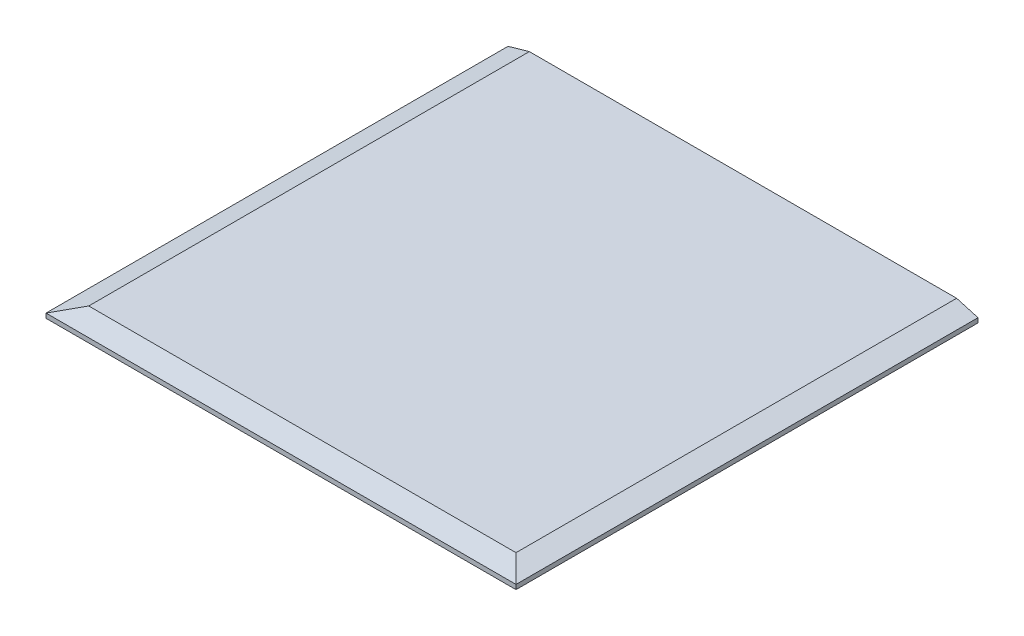
ISO-10303-21;
HEADER;
FILE_DESCRIPTION(('STEP AP214'),'2;1');
FILE_NAME('part.step','',(''),(''),'','','');
FILE_SCHEMA(('AUTOMOTIVE_DESIGN { 1 0 10303 214 1 1 1 1 }'));
ENDSEC;
DATA;
#1=APPLICATION_CONTEXT('core data for automotive mechanical design processes');
#2=APPLICATION_PROTOCOL_DEFINITION('international standard','automotive_design',2000,#1);
#3=PRODUCT_CONTEXT('',#1,'mechanical');
#4=PRODUCT('Part','Part','',(#3));
#5=PRODUCT_RELATED_PRODUCT_CATEGORY('part','',(#4));
#6=PRODUCT_DEFINITION_FORMATION('','',#4);
#7=PRODUCT_DEFINITION_CONTEXT('part definition',#1,'design');
#8=PRODUCT_DEFINITION('design','',#6,#7);
#9=PRODUCT_DEFINITION_SHAPE('','',#8);
#10=(LENGTH_UNIT() NAMED_UNIT(*) SI_UNIT(.MILLI.,.METRE.));
#11=(NAMED_UNIT(*) PLANE_ANGLE_UNIT() SI_UNIT($,.RADIAN.));
#12=(NAMED_UNIT(*) SI_UNIT($,.STERADIAN.) SOLID_ANGLE_UNIT());
#13=UNCERTAINTY_MEASURE_WITH_UNIT(LENGTH_MEASURE(1.E-05),#10,'distance_accuracy_value','');
#14=(GEOMETRIC_REPRESENTATION_CONTEXT(3) GLOBAL_UNCERTAINTY_ASSIGNED_CONTEXT((#13)) GLOBAL_UNIT_ASSIGNED_CONTEXT((#10,
#11,#12)) REPRESENTATION_CONTEXT('',''));
#15=CARTESIAN_POINT('',(0.,0.,0.));
#16=DIRECTION('',(0.,0.,1.));
#17=DIRECTION('',(1.,0.,0.));
#18=AXIS2_PLACEMENT_3D('',#15,#16,#17);
#19=CARTESIAN_POINT('',(279.4,9.05833360086324,536.575));
#20=DIRECTION('',(0.,0.961261695938317,0.275637355817005));
#21=DIRECTION('',(0.,-0.275637355817005,0.961261695938317));
#22=AXIS2_PLACEMENT_3D('',#19,#20,#21);
#23=PLANE('',#22);
#24=DIRECTION('',(1.,0.,0.));
#25=VECTOR('',#24,1.);
#26=CARTESIAN_POINT('',(558.8,12.7,523.875));
#27=LINE('',#26,#25);
#28=CARTESIAN_POINT('',(25.4,12.7000000000001,523.875));
#29=VERTEX_POINT('',#28);
#30=CARTESIAN_POINT('',(533.4,12.7000000000001,523.875));
#31=VERTEX_POINT('',#30);
#32=EDGE_CURVE('E67',#29,#31,#27,.T.);
#33=ORIENTED_EDGE('',*,*,#32,.F.);
#34=DIRECTION('',(0.693005033553599,0.198715995679127,-0.693005033553601));
#35=VECTOR('',#34,1.);
#36=CARTESIAN_POINT('',(0.,5.41666720172631,549.275));
#37=LINE('',#36,#35);
#38=CARTESIAN_POINT('',(0.,5.41666720172638,549.275));
#39=VERTEX_POINT('',#38);
#40=EDGE_CURVE('E88',#39,#29,#37,.T.);
#41=ORIENTED_EDGE('',*,*,#40,.F.);
#42=DIRECTION('',(1.,0.,0.));
#43=VECTOR('',#42,1.);
#44=CARTESIAN_POINT('',(0.,5.41666720172648,549.275));
#45=LINE('',#44,#43);
#46=CARTESIAN_POINT('',(558.8,5.41666720172638,549.275));
#47=VERTEX_POINT('',#46);
#48=EDGE_CURVE('E72',#47,#39,#45,.F.);
#49=ORIENTED_EDGE('',*,*,#48,.F.);
#50=DIRECTION('',(0.6930050335536,-0.198715995679127,0.6930050335536));
#51=VECTOR('',#50,1.);
#52=CARTESIAN_POINT('',(533.4,12.7000000000002,523.875));
#53=LINE('',#52,#51);
#54=EDGE_CURVE('E19',#31,#47,#53,.T.);
#55=ORIENTED_EDGE('',*,*,#54,.F.);
#56=EDGE_LOOP('',(#33,#41,#49,#55));
#57=FACE_BOUND('',#56,.T.);
#58=ADVANCED_FACE('F16',(#57),#23,.T.);
#59=CARTESIAN_POINT('',(546.1,9.05833360086324,274.6375));
#60=DIRECTION('',(0.275637355817005,0.961261695938317,0.));
#61=DIRECTION('',(-0.961261695938317,0.275637355817005,0.));
#62=AXIS2_PLACEMENT_3D('',#59,#60,#61);
#63=PLANE('',#62);
#64=DIRECTION('',(0.,0.,1.));
#65=VECTOR('',#64,1.);
#66=CARTESIAN_POINT('',(533.4,12.7,0.));
#67=LINE('',#66,#65);
#68=CARTESIAN_POINT('',(533.4,12.7000000000001,0.));
#69=VERTEX_POINT('',#68);
#70=EDGE_CURVE('E76',#31,#69,#67,.F.);
#71=ORIENTED_EDGE('',*,*,#70,.F.);
#72=ORIENTED_EDGE('',*,*,#54,.T.);
#73=DIRECTION('',(0.,0.,-1.));
#74=VECTOR('',#73,1.);
#75=CARTESIAN_POINT('',(558.8,5.41666720172648,0.));
#76=LINE('',#75,#74);
#77=CARTESIAN_POINT('',(558.8,5.4166672017264,0.));
#78=VERTEX_POINT('',#77);
#79=EDGE_CURVE('E92',#78,#47,#76,.F.);
#80=ORIENTED_EDGE('',*,*,#79,.F.);
#81=DIRECTION('',(-0.961261695938321,0.275637355816992,0.));
#82=VECTOR('',#81,1.);
#83=CARTESIAN_POINT('',(558.8,5.41666720172648,0.));
#84=LINE('',#83,#82);
#85=EDGE_CURVE('E80',#78,#69,#84,.T.);
#86=ORIENTED_EDGE('',*,*,#85,.T.);
#87=EDGE_LOOP('',(#71,#72,#80,#86));
#88=FACE_BOUND('',#87,.T.);
#89=ADVANCED_FACE('F78',(#88),#63,.T.);
#90=CARTESIAN_POINT('',(558.8,12.7,0.));
#91=DIRECTION('',(0.,1.,0.));
#92=DIRECTION('',(0.,0.,1.));
#93=AXIS2_PLACEMENT_3D('',#90,#91,#92);
#94=PLANE('',#93);
#95=DIRECTION('',(0.,0.,1.));
#96=VECTOR('',#95,1.);
#97=CARTESIAN_POINT('',(25.3999999999999,12.7000000000002,274.6375));
#98=LINE('',#97,#96);
#99=CARTESIAN_POINT('',(25.4,12.7,0.));
#100=VERTEX_POINT('',#99);
#101=EDGE_CURVE('E85',#29,#100,#98,.F.);
#102=ORIENTED_EDGE('',*,*,#101,.F.);
#103=ORIENTED_EDGE('',*,*,#32,.T.);
#104=ORIENTED_EDGE('',*,*,#70,.T.);
#105=DIRECTION('',(1.,0.,0.));
#106=VECTOR('',#105,1.);
#107=CARTESIAN_POINT('',(0.,12.7,0.));
#108=LINE('',#107,#106);
#109=EDGE_CURVE('E103',#69,#100,#108,.F.);
#110=ORIENTED_EDGE('',*,*,#109,.T.);
#111=EDGE_LOOP('',(#102,#103,#104,#110));
#112=FACE_BOUND('',#111,.T.);
#113=ADVANCED_FACE('F83',(#112),#94,.T.);
#114=CARTESIAN_POINT('',(12.7,9.05833360086324,274.6375));
#115=DIRECTION('',(-0.275637355817005,0.961261695938317,0.));
#116=DIRECTION('',(-0.961261695938317,-0.275637355817005,0.));
#117=AXIS2_PLACEMENT_3D('',#114,#115,#116);
#118=PLANE('',#117);
#119=DIRECTION('',(0.,0.,1.));
#120=VECTOR('',#119,1.);
#121=CARTESIAN_POINT('',(0.,5.41666720172648,0.));
#122=LINE('',#121,#120);
#123=CARTESIAN_POINT('',(0.,5.4166672017264,0.));
#124=VERTEX_POINT('',#123);
#125=EDGE_CURVE('E100',#39,#124,#122,.F.);
#126=ORIENTED_EDGE('',*,*,#125,.F.);
#127=ORIENTED_EDGE('',*,*,#40,.T.);
#128=ORIENTED_EDGE('',*,*,#101,.T.);
#129=DIRECTION('',(-0.961261695938321,-0.275637355816992,0.));
#130=VECTOR('',#129,1.);
#131=CARTESIAN_POINT('',(25.4,12.7,0.));
#132=LINE('',#131,#130);
#133=EDGE_CURVE('E105',#100,#124,#132,.T.);
#134=ORIENTED_EDGE('',*,*,#133,.T.);
#135=EDGE_LOOP('',(#126,#127,#128,#134));
#136=FACE_BOUND('',#135,.T.);
#137=ADVANCED_FACE('F126',(#136),#118,.T.);
#138=CARTESIAN_POINT('',(558.8,0.,0.));
#139=DIRECTION('',(1.,0.,0.));
#140=DIRECTION('',(0.,0.,-1.));
#141=AXIS2_PLACEMENT_3D('',#138,#139,#140);
#142=PLANE('',#141);
#143=DIRECTION('',(0.,1.,0.));
#144=VECTOR('',#143,1.);
#145=CARTESIAN_POINT('',(558.8,0.,0.));
#146=LINE('',#145,#144);
#147=CARTESIAN_POINT('',(558.8,0.,0.));
#148=VERTEX_POINT('',#147);
#149=EDGE_CURVE('E108',#148,#78,#146,.T.);
#150=ORIENTED_EDGE('',*,*,#149,.T.);
#151=ORIENTED_EDGE('',*,*,#79,.T.);
#152=DIRECTION('',(0.,1.,0.));
#153=VECTOR('',#152,1.);
#154=CARTESIAN_POINT('',(558.8,0.,549.275));
#155=LINE('',#154,#153);
#156=CARTESIAN_POINT('',(558.8,0.,549.275));
#157=VERTEX_POINT('',#156);
#158=EDGE_CURVE('E94',#157,#47,#155,.T.);
#159=ORIENTED_EDGE('',*,*,#158,.F.);
#160=DIRECTION('',(0.,0.,-1.));
#161=VECTOR('',#160,1.);
#162=CARTESIAN_POINT('',(558.8,0.,0.));
#163=LINE('',#162,#161);
#164=EDGE_CURVE('E111',#148,#157,#163,.F.);
#165=ORIENTED_EDGE('',*,*,#164,.F.);
#166=EDGE_LOOP('',(#150,#151,#159,#165));
#167=FACE_BOUND('',#166,.T.);
#168=ADVANCED_FACE('F132',(#167),#142,.T.);
#169=CARTESIAN_POINT('',(0.,0.,549.275));
#170=DIRECTION('',(0.,0.,1.));
#171=DIRECTION('',(1.,0.,0.));
#172=AXIS2_PLACEMENT_3D('',#169,#170,#171);
#173=PLANE('',#172);
#174=ORIENTED_EDGE('',*,*,#158,.T.);
#175=ORIENTED_EDGE('',*,*,#48,.T.);
#176=DIRECTION('',(0.,1.,0.));
#177=VECTOR('',#176,1.);
#178=CARTESIAN_POINT('',(0.,12.7,549.275));
#179=LINE('',#178,#177);
#180=CARTESIAN_POINT('',(0.,0.,549.275));
#181=VERTEX_POINT('',#180);
#182=EDGE_CURVE('E97',#181,#39,#179,.T.);
#183=ORIENTED_EDGE('',*,*,#182,.F.);
#184=DIRECTION('',(1.,0.,0.));
#185=VECTOR('',#184,1.);
#186=CARTESIAN_POINT('',(0.,0.,549.275));
#187=LINE('',#186,#185);
#188=EDGE_CURVE('E114',#157,#181,#187,.F.);
#189=ORIENTED_EDGE('',*,*,#188,.F.);
#190=EDGE_LOOP('',(#174,#175,#183,#189));
#191=FACE_BOUND('',#190,.T.);
#192=ADVANCED_FACE('F124',(#191),#173,.T.);
#193=CARTESIAN_POINT('',(0.,12.7,0.));
#194=DIRECTION('',(-1.,0.,0.));
#195=DIRECTION('',(0.,0.,1.));
#196=AXIS2_PLACEMENT_3D('',#193,#194,#195);
#197=PLANE('',#196);
#198=ORIENTED_EDGE('',*,*,#182,.T.);
#199=ORIENTED_EDGE('',*,*,#125,.T.);
#200=DIRECTION('',(0.,1.,0.));
#201=VECTOR('',#200,1.);
#202=CARTESIAN_POINT('',(0.,0.,0.));
#203=LINE('',#202,#201);
#204=CARTESIAN_POINT('',(0.,0.,0.));
#205=VERTEX_POINT('',#204);
#206=EDGE_CURVE('E34',#124,#205,#203,.F.);
#207=ORIENTED_EDGE('',*,*,#206,.T.);
#208=DIRECTION('',(0.,0.,-1.));
#209=VECTOR('',#208,1.);
#210=CARTESIAN_POINT('',(0.,0.,0.));
#211=LINE('',#210,#209);
#212=EDGE_CURVE('E25',#181,#205,#211,.T.);
#213=ORIENTED_EDGE('',*,*,#212,.F.);
#214=EDGE_LOOP('',(#198,#199,#207,#213));
#215=FACE_BOUND('',#214,.T.);
#216=ADVANCED_FACE('F121',(#215),#197,.T.);
#217=CARTESIAN_POINT('',(0.,0.,0.));
#218=DIRECTION('',(0.,0.,1.));
#219=DIRECTION('',(1.,0.,0.));
#220=AXIS2_PLACEMENT_3D('',#217,#218,#219);
#221=PLANE('',#220);
#222=DIRECTION('',(1.,0.,0.));
#223=VECTOR('',#222,1.);
#224=CARTESIAN_POINT('',(0.,0.,0.));
#225=LINE('',#224,#223);
#226=EDGE_CURVE('E11',#205,#148,#225,.T.);
#227=ORIENTED_EDGE('',*,*,#226,.F.);
#228=ORIENTED_EDGE('',*,*,#206,.F.);
#229=ORIENTED_EDGE('',*,*,#133,.F.);
#230=ORIENTED_EDGE('',*,*,#109,.F.);
#231=ORIENTED_EDGE('',*,*,#85,.F.);
#232=ORIENTED_EDGE('',*,*,#149,.F.);
#233=EDGE_LOOP('',(#227,#228,#229,#230,#231,#232));
#234=FACE_BOUND('',#233,.T.);
#235=ADVANCED_FACE('F129',(#234),#221,.F.);
#236=CARTESIAN_POINT('',(0.,0.,0.));
#237=DIRECTION('',(0.,-1.,0.));
#238=DIRECTION('',(0.,0.,-1.));
#239=AXIS2_PLACEMENT_3D('',#236,#237,#238);
#240=PLANE('',#239);
#241=ORIENTED_EDGE('',*,*,#212,.T.);
#242=ORIENTED_EDGE('',*,*,#226,.T.);
#243=ORIENTED_EDGE('',*,*,#164,.T.);
#244=ORIENTED_EDGE('',*,*,#188,.T.);
#245=EDGE_LOOP('',(#241,#242,#243,#244));
#246=FACE_BOUND('',#245,.T.);
#247=ADVANCED_FACE('F119',(#246),#240,.T.);
#248=CLOSED_SHELL('',(#58,#89,#113,#137,#168,#192,#216,#235,#247));
#249=MANIFOLD_SOLID_BREP('B1',#248);
#250=ADVANCED_BREP_SHAPE_REPRESENTATION('',(#18,#249),#14);
#251=SHAPE_DEFINITION_REPRESENTATION(#9,#250);
ENDSEC;
END-ISO-10303-21;
